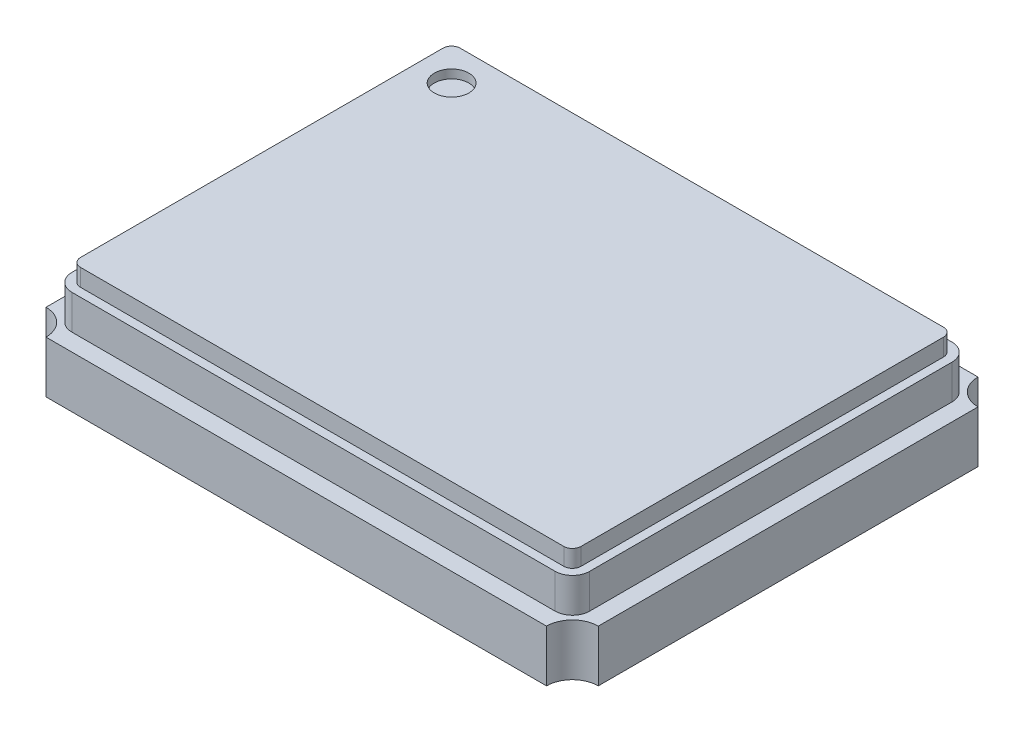
ISO-10303-21;
HEADER;
FILE_DESCRIPTION(('STEP AP214'),'2;1');
FILE_NAME('part.step','',(''),(''),'','','');
FILE_SCHEMA(('AUTOMOTIVE_DESIGN { 1 0 10303 214 1 1 1 1 }'));
ENDSEC;
DATA;
#1=APPLICATION_CONTEXT('core data for automotive mechanical design processes');
#2=APPLICATION_PROTOCOL_DEFINITION('international standard','automotive_design',2000,#1);
#3=PRODUCT_CONTEXT('',#1,'mechanical');
#4=PRODUCT('Part','Part','',(#3));
#5=PRODUCT_RELATED_PRODUCT_CATEGORY('part','',(#4));
#6=PRODUCT_DEFINITION_FORMATION('','',#4);
#7=PRODUCT_DEFINITION_CONTEXT('part definition',#1,'design');
#8=PRODUCT_DEFINITION('design','',#6,#7);
#9=PRODUCT_DEFINITION_SHAPE('','',#8);
#10=(LENGTH_UNIT() NAMED_UNIT(*) SI_UNIT(.MILLI.,.METRE.));
#11=(NAMED_UNIT(*) PLANE_ANGLE_UNIT() SI_UNIT($,.RADIAN.));
#12=(NAMED_UNIT(*) SI_UNIT($,.STERADIAN.) SOLID_ANGLE_UNIT());
#13=UNCERTAINTY_MEASURE_WITH_UNIT(LENGTH_MEASURE(1.E-05),#10,'distance_accuracy_value','');
#14=(GEOMETRIC_REPRESENTATION_CONTEXT(3) GLOBAL_UNCERTAINTY_ASSIGNED_CONTEXT((#13)) GLOBAL_UNIT_ASSIGNED_CONTEXT((#10,
#11,#12)) REPRESENTATION_CONTEXT('',''));
#15=CARTESIAN_POINT('',(0.,0.,0.));
#16=DIRECTION('',(0.,0.,1.));
#17=DIRECTION('',(1.,0.,0.));
#18=AXIS2_PLACEMENT_3D('',#15,#16,#17);
#19=CARTESIAN_POINT('',(-1.4,0.5,1.05));
#20=DIRECTION('',(0.,-1.,0.));
#21=DIRECTION('',(0.,0.,-1.));
#22=AXIS2_PLACEMENT_3D('',#19,#20,#21);
#23=PLANE('',#22);
#24=CARTESIAN_POINT('',(-1.4,0.5,1.05));
#25=DIRECTION('',(0.,1.,0.));
#26=DIRECTION('',(0.,0.,-1.));
#27=AXIS2_PLACEMENT_3D('',#24,#25,#26);
#28=CIRCLE('',#27,0.1);
#29=CARTESIAN_POINT('',(-1.5,0.5,1.05));
#30=VERTEX_POINT('',#29);
#31=CARTESIAN_POINT('',(-1.4,0.5,1.15));
#32=VERTEX_POINT('',#31);
#33=EDGE_CURVE('E257',#30,#32,#28,.T.);
#34=ORIENTED_EDGE('',*,*,#33,.T.);
#35=DIRECTION('',(1.,0.,0.));
#36=VECTOR('',#35,1.);
#37=CARTESIAN_POINT('',(-1.4,0.5,1.15));
#38=LINE('',#37,#36);
#39=CARTESIAN_POINT('',(1.4,0.5,1.15));
#40=VERTEX_POINT('',#39);
#41=EDGE_CURVE('E291',#32,#40,#38,.T.);
#42=ORIENTED_EDGE('',*,*,#41,.T.);
#43=CARTESIAN_POINT('',(1.4,0.5,1.05));
#44=DIRECTION('',(0.,1.,0.));
#45=DIRECTION('',(0.,0.,1.));
#46=AXIS2_PLACEMENT_3D('',#43,#44,#45);
#47=CIRCLE('',#46,0.1);
#48=CARTESIAN_POINT('',(1.5,0.5,1.05));
#49=VERTEX_POINT('',#48);
#50=EDGE_CURVE('E289',#40,#49,#47,.T.);
#51=ORIENTED_EDGE('',*,*,#50,.T.);
#52=DIRECTION('',(0.,0.,-1.));
#53=VECTOR('',#52,1.);
#54=CARTESIAN_POINT('',(1.5,0.5,1.05));
#55=LINE('',#54,#53);
#56=CARTESIAN_POINT('',(1.5,0.5,-1.05));
#57=VERTEX_POINT('',#56);
#58=EDGE_CURVE('E287',#49,#57,#55,.T.);
#59=ORIENTED_EDGE('',*,*,#58,.T.);
#60=CARTESIAN_POINT('',(1.4,0.5,-1.05));
#61=DIRECTION('',(0.,1.,0.));
#62=DIRECTION('',(0.,0.,-1.));
#63=AXIS2_PLACEMENT_3D('',#60,#61,#62);
#64=CIRCLE('',#63,0.1);
#65=CARTESIAN_POINT('',(1.4,0.5,-1.15));
#66=VERTEX_POINT('',#65);
#67=EDGE_CURVE('E285',#57,#66,#64,.T.);
#68=ORIENTED_EDGE('',*,*,#67,.T.);
#69=DIRECTION('',(-1.,0.,0.));
#70=VECTOR('',#69,1.);
#71=CARTESIAN_POINT('',(-1.4,0.5,-1.15));
#72=LINE('',#71,#70);
#73=CARTESIAN_POINT('',(-1.4,0.5,-1.15));
#74=VERTEX_POINT('',#73);
#75=EDGE_CURVE('E283',#66,#74,#72,.T.);
#76=ORIENTED_EDGE('',*,*,#75,.T.);
#77=CARTESIAN_POINT('',(-1.4,0.5,-1.05));
#78=DIRECTION('',(0.,1.,0.));
#79=DIRECTION('',(0.,0.,-1.));
#80=AXIS2_PLACEMENT_3D('',#77,#78,#79);
#81=CIRCLE('',#80,0.1);
#82=CARTESIAN_POINT('',(-1.5,0.5,-1.05));
#83=VERTEX_POINT('',#82);
#84=EDGE_CURVE('E281',#74,#83,#81,.T.);
#85=ORIENTED_EDGE('',*,*,#84,.T.);
#86=DIRECTION('',(0.,0.,1.));
#87=VECTOR('',#86,1.);
#88=CARTESIAN_POINT('',(-1.5,0.5,1.05));
#89=LINE('',#88,#87);
#90=EDGE_CURVE('E253',#83,#30,#89,.T.);
#91=ORIENTED_EDGE('',*,*,#90,.T.);
#92=EDGE_LOOP('',(#34,#42,#51,#59,#68,#76,#85,#91));
#93=FACE_BOUND('',#92,.T.);
#94=CARTESIAN_POINT('',(1.4,0.5,-1.05));
#95=DIRECTION('',(0.,1.,0.));
#96=DIRECTION('',(0.,0.,-1.));
#97=AXIS2_PLACEMENT_3D('',#94,#95,#96);
#98=CIRCLE('',#97,0.0499999999999999);
#99=CARTESIAN_POINT('',(1.45,0.5,-1.05));
#100=VERTEX_POINT('',#99);
#101=CARTESIAN_POINT('',(1.4,0.5,-1.1));
#102=VERTEX_POINT('',#101);
#103=EDGE_CURVE('E341',#100,#102,#98,.T.);
#104=ORIENTED_EDGE('',*,*,#103,.F.);
#105=DIRECTION('',(0.,0.,-1.));
#106=VECTOR('',#105,1.);
#107=CARTESIAN_POINT('',(1.45,0.5,1.05));
#108=LINE('',#107,#106);
#109=CARTESIAN_POINT('',(1.45,0.5,1.05));
#110=VERTEX_POINT('',#109);
#111=EDGE_CURVE('E319',#110,#100,#108,.T.);
#112=ORIENTED_EDGE('',*,*,#111,.F.);
#113=CARTESIAN_POINT('',(1.4,0.5,1.05));
#114=DIRECTION('',(0.,1.,0.));
#115=DIRECTION('',(0.,0.,1.));
#116=AXIS2_PLACEMENT_3D('',#113,#114,#115);
#117=CIRCLE('',#116,0.0499999999999999);
#118=CARTESIAN_POINT('',(1.4,0.5,1.1));
#119=VERTEX_POINT('',#118);
#120=EDGE_CURVE('E323',#119,#110,#117,.T.);
#121=ORIENTED_EDGE('',*,*,#120,.F.);
#122=DIRECTION('',(1.,0.,0.));
#123=VECTOR('',#122,1.);
#124=CARTESIAN_POINT('',(-1.4,0.5,1.1));
#125=LINE('',#124,#123);
#126=CARTESIAN_POINT('',(-1.4,0.5,1.1));
#127=VERTEX_POINT('',#126);
#128=EDGE_CURVE('E326',#127,#119,#125,.T.);
#129=ORIENTED_EDGE('',*,*,#128,.F.);
#130=CARTESIAN_POINT('',(-1.4,0.5,1.05));
#131=DIRECTION('',(0.,1.,0.));
#132=DIRECTION('',(0.,0.,-1.));
#133=AXIS2_PLACEMENT_3D('',#130,#131,#132);
#134=CIRCLE('',#133,0.0499999999999999);
#135=CARTESIAN_POINT('',(-1.45,0.5,1.05));
#136=VERTEX_POINT('',#135);
#137=EDGE_CURVE('E329',#136,#127,#134,.T.);
#138=ORIENTED_EDGE('',*,*,#137,.F.);
#139=DIRECTION('',(0.,0.,1.));
#140=VECTOR('',#139,1.);
#141=CARTESIAN_POINT('',(-1.45,0.5,1.05));
#142=LINE('',#141,#140);
#143=CARTESIAN_POINT('',(-1.45,0.5,-1.05));
#144=VERTEX_POINT('',#143);
#145=EDGE_CURVE('E332',#144,#136,#142,.T.);
#146=ORIENTED_EDGE('',*,*,#145,.F.);
#147=CARTESIAN_POINT('',(-1.4,0.5,-1.05));
#148=DIRECTION('',(0.,1.,0.));
#149=DIRECTION('',(0.,0.,-1.));
#150=AXIS2_PLACEMENT_3D('',#147,#148,#149);
#151=CIRCLE('',#150,0.0499999999999999);
#152=CARTESIAN_POINT('',(-1.4,0.5,-1.1));
#153=VERTEX_POINT('',#152);
#154=EDGE_CURVE('E335',#153,#144,#151,.T.);
#155=ORIENTED_EDGE('',*,*,#154,.F.);
#156=DIRECTION('',(-1.,0.,0.));
#157=VECTOR('',#156,1.);
#158=CARTESIAN_POINT('',(-1.4,0.5,-1.1));
#159=LINE('',#158,#157);
#160=EDGE_CURVE('E338',#102,#153,#159,.T.);
#161=ORIENTED_EDGE('',*,*,#160,.F.);
#162=EDGE_LOOP('',(#104,#112,#121,#129,#138,#146,#155,#161));
#163=FACE_BOUND('',#162,.T.);
#164=ADVANCED_FACE('F33',(#93,#163),#23,.F.);
#165=CARTESIAN_POINT('',(0.,0.3,0.));
#166=DIRECTION('',(0.,-1.,0.));
#167=DIRECTION('',(0.,0.,-1.));
#168=AXIS2_PLACEMENT_3D('',#165,#166,#167);
#169=PLANE('',#168);
#170=DIRECTION('',(0.,0.,1.));
#171=VECTOR('',#170,1.);
#172=CARTESIAN_POINT('',(-1.6,0.3,1.25));
#173=LINE('',#172,#171);
#174=CARTESIAN_POINT('',(-1.6,0.3,-1.1));
#175=VERTEX_POINT('',#174);
#176=CARTESIAN_POINT('',(-1.6,0.3,1.1));
#177=VERTEX_POINT('',#176);
#178=EDGE_CURVE('E207',#175,#177,#173,.T.);
#179=ORIENTED_EDGE('',*,*,#178,.T.);
#180=CARTESIAN_POINT('',(-1.6,0.3,1.25));
#181=DIRECTION('',(0.,1.,0.));
#182=DIRECTION('',(0.,0.,-1.));
#183=AXIS2_PLACEMENT_3D('',#180,#181,#182);
#184=CIRCLE('',#183,0.15);
#185=CARTESIAN_POINT('',(-1.45,0.3,1.25));
#186=VERTEX_POINT('',#185);
#187=EDGE_CURVE('E378',#186,#177,#184,.T.);
#188=ORIENTED_EDGE('',*,*,#187,.F.);
#189=DIRECTION('',(1.,0.,0.));
#190=VECTOR('',#189,1.);
#191=CARTESIAN_POINT('',(-1.6,0.3,1.25));
#192=LINE('',#191,#190);
#193=CARTESIAN_POINT('',(1.45,0.3,1.25));
#194=VERTEX_POINT('',#193);
#195=EDGE_CURVE('E41',#186,#194,#192,.T.);
#196=ORIENTED_EDGE('',*,*,#195,.T.);
#197=CARTESIAN_POINT('',(1.6,0.3,1.25));
#198=DIRECTION('',(0.,1.,0.));
#199=DIRECTION('',(0.,0.,1.));
#200=AXIS2_PLACEMENT_3D('',#197,#198,#199);
#201=CIRCLE('',#200,0.15);
#202=CARTESIAN_POINT('',(1.6,0.3,1.1));
#203=VERTEX_POINT('',#202);
#204=EDGE_CURVE('E380',#203,#194,#201,.T.);
#205=ORIENTED_EDGE('',*,*,#204,.F.);
#206=DIRECTION('',(0.,0.,-1.));
#207=VECTOR('',#206,1.);
#208=CARTESIAN_POINT('',(1.6,0.3,1.25));
#209=LINE('',#208,#207);
#210=CARTESIAN_POINT('',(1.6,0.3,-1.1));
#211=VERTEX_POINT('',#210);
#212=EDGE_CURVE('E215',#203,#211,#209,.T.);
#213=ORIENTED_EDGE('',*,*,#212,.T.);
#214=CARTESIAN_POINT('',(1.6,0.3,-1.25));
#215=DIRECTION('',(0.,1.,0.));
#216=DIRECTION('',(0.,0.,-1.));
#217=AXIS2_PLACEMENT_3D('',#214,#215,#216);
#218=CIRCLE('',#217,0.15);
#219=CARTESIAN_POINT('',(1.45,0.3,-1.25));
#220=VERTEX_POINT('',#219);
#221=EDGE_CURVE('E386',#220,#211,#218,.T.);
#222=ORIENTED_EDGE('',*,*,#221,.F.);
#223=DIRECTION('',(-1.,0.,0.));
#224=VECTOR('',#223,1.);
#225=CARTESIAN_POINT('',(-1.6,0.3,-1.25));
#226=LINE('',#225,#224);
#227=CARTESIAN_POINT('',(-1.45,0.3,-1.25));
#228=VERTEX_POINT('',#227);
#229=EDGE_CURVE('E225',#220,#228,#226,.T.);
#230=ORIENTED_EDGE('',*,*,#229,.T.);
#231=CARTESIAN_POINT('',(-1.6,0.3,-1.25));
#232=DIRECTION('',(0.,1.,0.));
#233=DIRECTION('',(0.,0.,1.));
#234=AXIS2_PLACEMENT_3D('',#231,#232,#233);
#235=CIRCLE('',#234,0.15);
#236=EDGE_CURVE('E199',#175,#228,#235,.T.);
#237=ORIENTED_EDGE('',*,*,#236,.F.);
#238=EDGE_LOOP('',(#179,#188,#196,#205,#213,#222,#230,#237));
#239=FACE_BOUND('',#238,.T.);
#240=CARTESIAN_POINT('',(-1.4,0.3,1.05));
#241=DIRECTION('',(0.,1.,0.));
#242=DIRECTION('',(0.,0.,-1.));
#243=AXIS2_PLACEMENT_3D('',#240,#241,#242);
#244=CIRCLE('',#243,0.1);
#245=CARTESIAN_POINT('',(-1.5,0.3,1.05));
#246=VERTEX_POINT('',#245);
#247=CARTESIAN_POINT('',(-1.4,0.3,1.15));
#248=VERTEX_POINT('',#247);
#249=EDGE_CURVE('E276',#246,#248,#244,.T.);
#250=ORIENTED_EDGE('',*,*,#249,.F.);
#251=DIRECTION('',(0.,0.,1.));
#252=VECTOR('',#251,1.);
#253=CARTESIAN_POINT('',(-1.5,0.3,1.05));
#254=LINE('',#253,#252);
#255=CARTESIAN_POINT('',(-1.5,0.3,-1.05));
#256=VERTEX_POINT('',#255);
#257=EDGE_CURVE('E254',#256,#246,#254,.T.);
#258=ORIENTED_EDGE('',*,*,#257,.F.);
#259=CARTESIAN_POINT('',(-1.4,0.3,-1.05));
#260=DIRECTION('',(0.,1.,0.));
#261=DIRECTION('',(0.,0.,-1.));
#262=AXIS2_PLACEMENT_3D('',#259,#260,#261);
#263=CIRCLE('',#262,0.1);
#264=CARTESIAN_POINT('',(-1.4,0.3,-1.15));
#265=VERTEX_POINT('',#264);
#266=EDGE_CURVE('E258',#265,#256,#263,.T.);
#267=ORIENTED_EDGE('',*,*,#266,.F.);
#268=DIRECTION('',(-1.,0.,0.));
#269=VECTOR('',#268,1.);
#270=CARTESIAN_POINT('',(-1.4,0.3,-1.15));
#271=LINE('',#270,#269);
#272=CARTESIAN_POINT('',(1.4,0.3,-1.15));
#273=VERTEX_POINT('',#272);
#274=EDGE_CURVE('E261',#273,#265,#271,.T.);
#275=ORIENTED_EDGE('',*,*,#274,.F.);
#276=CARTESIAN_POINT('',(1.4,0.3,-1.05));
#277=DIRECTION('',(0.,1.,0.));
#278=DIRECTION('',(0.,0.,-1.));
#279=AXIS2_PLACEMENT_3D('',#276,#277,#278);
#280=CIRCLE('',#279,0.1);
#281=CARTESIAN_POINT('',(1.5,0.3,-1.05));
#282=VERTEX_POINT('',#281);
#283=EDGE_CURVE('E264',#282,#273,#280,.T.);
#284=ORIENTED_EDGE('',*,*,#283,.F.);
#285=DIRECTION('',(0.,0.,-1.));
#286=VECTOR('',#285,1.);
#287=CARTESIAN_POINT('',(1.5,0.3,1.05));
#288=LINE('',#287,#286);
#289=CARTESIAN_POINT('',(1.5,0.3,1.05));
#290=VERTEX_POINT('',#289);
#291=EDGE_CURVE('E267',#290,#282,#288,.T.);
#292=ORIENTED_EDGE('',*,*,#291,.F.);
#293=CARTESIAN_POINT('',(1.4,0.3,1.05));
#294=DIRECTION('',(0.,1.,0.));
#295=DIRECTION('',(0.,0.,1.));
#296=AXIS2_PLACEMENT_3D('',#293,#294,#295);
#297=CIRCLE('',#296,0.1);
#298=CARTESIAN_POINT('',(1.4,0.3,1.15));
#299=VERTEX_POINT('',#298);
#300=EDGE_CURVE('E270',#299,#290,#297,.T.);
#301=ORIENTED_EDGE('',*,*,#300,.F.);
#302=DIRECTION('',(1.,0.,0.));
#303=VECTOR('',#302,1.);
#304=CARTESIAN_POINT('',(-1.4,0.3,1.15));
#305=LINE('',#304,#303);
#306=EDGE_CURVE('E273',#248,#299,#305,.T.);
#307=ORIENTED_EDGE('',*,*,#306,.F.);
#308=EDGE_LOOP('',(#250,#258,#267,#275,#284,#292,#301,#307));
#309=FACE_BOUND('',#308,.T.);
#310=ADVANCED_FACE('F442',(#239,#309),#169,.F.);
#311=CARTESIAN_POINT('',(1.6,0.3,1.25));
#312=DIRECTION('',(-1.,0.,0.));
#313=DIRECTION('',(0.,0.,1.));
#314=AXIS2_PLACEMENT_3D('',#311,#312,#313);
#315=PLANE('',#314);
#316=ORIENTED_EDGE('',*,*,#212,.F.);
#317=DIRECTION('',(0.,1.,0.));
#318=VECTOR('',#317,1.);
#319=CARTESIAN_POINT('',(1.6,0.,1.1));
#320=LINE('',#319,#318);
#321=CARTESIAN_POINT('',(1.6,0.,1.1));
#322=VERTEX_POINT('',#321);
#323=EDGE_CURVE('E363',#203,#322,#320,.F.);
#324=ORIENTED_EDGE('',*,*,#323,.T.);
#325=DIRECTION('',(0.,0.,-1.));
#326=VECTOR('',#325,1.);
#327=CARTESIAN_POINT('',(1.6,0.,1.25));
#328=LINE('',#327,#326);
#329=CARTESIAN_POINT('',(1.6,0.,-1.1));
#330=VERTEX_POINT('',#329);
#331=EDGE_CURVE('E216',#322,#330,#328,.T.);
#332=ORIENTED_EDGE('',*,*,#331,.T.);
#333=DIRECTION('',(0.,1.,0.));
#334=VECTOR('',#333,1.);
#335=CARTESIAN_POINT('',(1.6,0.,-1.1));
#336=LINE('',#335,#334);
#337=EDGE_CURVE('E369',#330,#211,#336,.T.);
#338=ORIENTED_EDGE('',*,*,#337,.T.);
#339=EDGE_LOOP('',(#316,#324,#332,#338));
#340=FACE_BOUND('',#339,.T.);
#341=ADVANCED_FACE('F35',(#340),#315,.F.);
#342=CARTESIAN_POINT('',(-1.6,0.3,-1.25));
#343=DIRECTION('',(0.,0.,1.));
#344=DIRECTION('',(1.,0.,0.));
#345=AXIS2_PLACEMENT_3D('',#342,#343,#344);
#346=PLANE('',#345);
#347=ORIENTED_EDGE('',*,*,#229,.F.);
#348=DIRECTION('',(0.,1.,0.));
#349=VECTOR('',#348,1.);
#350=CARTESIAN_POINT('',(1.45,0.,-1.25));
#351=LINE('',#350,#349);
#352=CARTESIAN_POINT('',(1.45,0.,-1.25));
#353=VERTEX_POINT('',#352);
#354=EDGE_CURVE('E372',#220,#353,#351,.F.);
#355=ORIENTED_EDGE('',*,*,#354,.T.);
#356=DIRECTION('',(-1.,0.,0.));
#357=VECTOR('',#356,1.);
#358=CARTESIAN_POINT('',(-1.6,0.,-1.25));
#359=LINE('',#358,#357);
#360=CARTESIAN_POINT('',(-1.45,0.,-1.25));
#361=VERTEX_POINT('',#360);
#362=EDGE_CURVE('E212',#353,#361,#359,.T.);
#363=ORIENTED_EDGE('',*,*,#362,.T.);
#364=DIRECTION('',(0.,1.,0.));
#365=VECTOR('',#364,1.);
#366=CARTESIAN_POINT('',(-1.45,0.,-1.25));
#367=LINE('',#366,#365);
#368=EDGE_CURVE('E48',#361,#228,#367,.T.);
#369=ORIENTED_EDGE('',*,*,#368,.T.);
#370=EDGE_LOOP('',(#347,#355,#363,#369));
#371=FACE_BOUND('',#370,.T.);
#372=ADVANCED_FACE('F492',(#371),#346,.F.);
#373=CARTESIAN_POINT('',(-1.6,0.3,1.25));
#374=DIRECTION('',(1.,0.,0.));
#375=DIRECTION('',(0.,0.,-1.));
#376=AXIS2_PLACEMENT_3D('',#373,#374,#375);
#377=PLANE('',#376);
#378=DIRECTION('',(0.,0.,1.));
#379=VECTOR('',#378,1.);
#380=CARTESIAN_POINT('',(-1.6,0.,1.25));
#381=LINE('',#380,#379);
#382=CARTESIAN_POINT('',(-1.6,0.,-1.1));
#383=VERTEX_POINT('',#382);
#384=CARTESIAN_POINT('',(-1.6,0.,1.1));
#385=VERTEX_POINT('',#384);
#386=EDGE_CURVE('E205',#383,#385,#381,.T.);
#387=ORIENTED_EDGE('',*,*,#386,.T.);
#388=DIRECTION('',(0.,1.,0.));
#389=VECTOR('',#388,1.);
#390=CARTESIAN_POINT('',(-1.6,0.,1.1));
#391=LINE('',#390,#389);
#392=EDGE_CURVE('E55',#385,#177,#391,.T.);
#393=ORIENTED_EDGE('',*,*,#392,.T.);
#394=ORIENTED_EDGE('',*,*,#178,.F.);
#395=DIRECTION('',(0.,1.,0.));
#396=VECTOR('',#395,1.);
#397=CARTESIAN_POINT('',(-1.6,0.,-1.1));
#398=LINE('',#397,#396);
#399=EDGE_CURVE('E193',#175,#383,#398,.F.);
#400=ORIENTED_EDGE('',*,*,#399,.T.);
#401=EDGE_LOOP('',(#387,#393,#394,#400));
#402=FACE_BOUND('',#401,.T.);
#403=ADVANCED_FACE('F204',(#402),#377,.F.);
#404=CARTESIAN_POINT('',(-1.6,0.3,1.25));
#405=DIRECTION('',(0.,0.,-1.));
#406=DIRECTION('',(-1.,0.,0.));
#407=AXIS2_PLACEMENT_3D('',#404,#405,#406);
#408=PLANE('',#407);
#409=ORIENTED_EDGE('',*,*,#195,.F.);
#410=DIRECTION('',(0.,1.,0.));
#411=VECTOR('',#410,1.);
#412=CARTESIAN_POINT('',(-1.45,0.,1.25));
#413=LINE('',#412,#411);
#414=CARTESIAN_POINT('',(-1.45,0.,1.25));
#415=VERTEX_POINT('',#414);
#416=EDGE_CURVE('E360',#186,#415,#413,.F.);
#417=ORIENTED_EDGE('',*,*,#416,.T.);
#418=DIRECTION('',(1.,0.,0.));
#419=VECTOR('',#418,1.);
#420=CARTESIAN_POINT('',(-1.6,0.,1.25));
#421=LINE('',#420,#419);
#422=CARTESIAN_POINT('',(1.45,0.,1.25));
#423=VERTEX_POINT('',#422);
#424=EDGE_CURVE('E211',#415,#423,#421,.T.);
#425=ORIENTED_EDGE('',*,*,#424,.T.);
#426=DIRECTION('',(0.,1.,0.));
#427=VECTOR('',#426,1.);
#428=CARTESIAN_POINT('',(1.45,0.,1.25));
#429=LINE('',#428,#427);
#430=EDGE_CURVE('E366',#423,#194,#429,.T.);
#431=ORIENTED_EDGE('',*,*,#430,.T.);
#432=EDGE_LOOP('',(#409,#417,#425,#431));
#433=FACE_BOUND('',#432,.T.);
#434=ADVANCED_FACE('F487',(#433),#408,.F.);
#435=CARTESIAN_POINT('',(0.,0.,0.));
#436=DIRECTION('',(0.,-1.,0.));
#437=DIRECTION('',(0.,0.,-1.));
#438=AXIS2_PLACEMENT_3D('',#435,#436,#437);
#439=PLANE('',#438);
#440=CARTESIAN_POINT('',(-1.6,0.,1.25));
#441=DIRECTION('',(0.,-1.,0.));
#442=DIRECTION('',(0.,0.,-1.));
#443=AXIS2_PLACEMENT_3D('',#440,#441,#442);
#444=CIRCLE('',#443,0.15);
#445=EDGE_CURVE('E11',#385,#415,#444,.T.);
#446=ORIENTED_EDGE('',*,*,#445,.F.);
#447=ORIENTED_EDGE('',*,*,#386,.F.);
#448=CARTESIAN_POINT('',(-1.6,0.,-1.25));
#449=DIRECTION('',(0.,1.,0.));
#450=DIRECTION('',(0.,0.,1.));
#451=AXIS2_PLACEMENT_3D('',#448,#449,#450);
#452=CIRCLE('',#451,0.15);
#453=EDGE_CURVE('E190',#383,#361,#452,.T.);
#454=ORIENTED_EDGE('',*,*,#453,.T.);
#455=ORIENTED_EDGE('',*,*,#362,.F.);
#456=CARTESIAN_POINT('',(1.6,0.,-1.25));
#457=DIRECTION('',(0.,1.,0.));
#458=DIRECTION('',(0.,0.,-1.));
#459=AXIS2_PLACEMENT_3D('',#456,#457,#458);
#460=CIRCLE('',#459,0.15);
#461=EDGE_CURVE('E376',#353,#330,#460,.T.);
#462=ORIENTED_EDGE('',*,*,#461,.T.);
#463=ORIENTED_EDGE('',*,*,#331,.F.);
#464=CARTESIAN_POINT('',(1.6,0.,1.25));
#465=DIRECTION('',(0.,1.,0.));
#466=DIRECTION('',(0.,0.,1.));
#467=AXIS2_PLACEMENT_3D('',#464,#465,#466);
#468=CIRCLE('',#467,0.15);
#469=EDGE_CURVE('E383',#322,#423,#468,.T.);
#470=ORIENTED_EDGE('',*,*,#469,.T.);
#471=ORIENTED_EDGE('',*,*,#424,.F.);
#472=EDGE_LOOP('',(#446,#447,#454,#455,#462,#463,#470,#471));
#473=FACE_BOUND('',#472,.T.);
#474=ADVANCED_FACE('F209',(#473),#439,.T.);
#475=CARTESIAN_POINT('',(-1.4,0.5,1.05));
#476=DIRECTION('',(0.,-1.,0.));
#477=DIRECTION('',(0.,0.,-1.));
#478=AXIS2_PLACEMENT_3D('',#475,#476,#477);
#479=CYLINDRICAL_SURFACE('',#478,0.1);
#480=ORIENTED_EDGE('',*,*,#249,.T.);
#481=DIRECTION('',(0.,-1.,0.));
#482=VECTOR('',#481,1.);
#483=CARTESIAN_POINT('',(-1.4,0.5,1.15));
#484=LINE('',#483,#482);
#485=EDGE_CURVE('E221',#32,#248,#484,.T.);
#486=ORIENTED_EDGE('',*,*,#485,.F.);
#487=ORIENTED_EDGE('',*,*,#33,.F.);
#488=DIRECTION('',(0.,-1.,0.));
#489=VECTOR('',#488,1.);
#490=CARTESIAN_POINT('',(-1.5,0.5,1.05));
#491=LINE('',#490,#489);
#492=EDGE_CURVE('E250',#30,#246,#491,.T.);
#493=ORIENTED_EDGE('',*,*,#492,.T.);
#494=EDGE_LOOP('',(#480,#486,#487,#493));
#495=FACE_BOUND('',#494,.T.);
#496=ADVANCED_FACE('F480',(#495),#479,.T.);
#497=CARTESIAN_POINT('',(-1.4,0.5,1.15));
#498=DIRECTION('',(0.,0.,-1.));
#499=DIRECTION('',(-1.,0.,0.));
#500=AXIS2_PLACEMENT_3D('',#497,#498,#499);
#501=PLANE('',#500);
#502=ORIENTED_EDGE('',*,*,#306,.T.);
#503=DIRECTION('',(0.,-1.,0.));
#504=VECTOR('',#503,1.);
#505=CARTESIAN_POINT('',(1.4,0.5,1.15));
#506=LINE('',#505,#504);
#507=EDGE_CURVE('E232',#40,#299,#506,.T.);
#508=ORIENTED_EDGE('',*,*,#507,.F.);
#509=ORIENTED_EDGE('',*,*,#41,.F.);
#510=ORIENTED_EDGE('',*,*,#485,.T.);
#511=EDGE_LOOP('',(#502,#508,#509,#510));
#512=FACE_BOUND('',#511,.T.);
#513=ADVANCED_FACE('F476',(#512),#501,.F.);
#514=CARTESIAN_POINT('',(1.4,0.5,1.05));
#515=DIRECTION('',(0.,-1.,0.));
#516=DIRECTION('',(0.,0.,-1.));
#517=AXIS2_PLACEMENT_3D('',#514,#515,#516);
#518=CYLINDRICAL_SURFACE('',#517,0.1);
#519=ORIENTED_EDGE('',*,*,#300,.T.);
#520=DIRECTION('',(0.,-1.,0.));
#521=VECTOR('',#520,1.);
#522=CARTESIAN_POINT('',(1.5,0.5,1.05));
#523=LINE('',#522,#521);
#524=EDGE_CURVE('E235',#49,#290,#523,.T.);
#525=ORIENTED_EDGE('',*,*,#524,.F.);
#526=ORIENTED_EDGE('',*,*,#50,.F.);
#527=ORIENTED_EDGE('',*,*,#507,.T.);
#528=EDGE_LOOP('',(#519,#525,#526,#527));
#529=FACE_BOUND('',#528,.T.);
#530=ADVANCED_FACE('F472',(#529),#518,.T.);
#531=CARTESIAN_POINT('',(1.5,0.5,1.05));
#532=DIRECTION('',(-1.,0.,0.));
#533=DIRECTION('',(0.,0.,1.));
#534=AXIS2_PLACEMENT_3D('',#531,#532,#533);
#535=PLANE('',#534);
#536=ORIENTED_EDGE('',*,*,#291,.T.);
#537=DIRECTION('',(0.,-1.,0.));
#538=VECTOR('',#537,1.);
#539=CARTESIAN_POINT('',(1.5,0.5,-1.05));
#540=LINE('',#539,#538);
#541=EDGE_CURVE('E238',#57,#282,#540,.T.);
#542=ORIENTED_EDGE('',*,*,#541,.F.);
#543=ORIENTED_EDGE('',*,*,#58,.F.);
#544=ORIENTED_EDGE('',*,*,#524,.T.);
#545=EDGE_LOOP('',(#536,#542,#543,#544));
#546=FACE_BOUND('',#545,.T.);
#547=ADVANCED_FACE('F468',(#546),#535,.F.);
#548=CARTESIAN_POINT('',(1.4,0.5,-1.05));
#549=DIRECTION('',(0.,-1.,0.));
#550=DIRECTION('',(0.,0.,-1.));
#551=AXIS2_PLACEMENT_3D('',#548,#549,#550);
#552=CYLINDRICAL_SURFACE('',#551,0.1);
#553=ORIENTED_EDGE('',*,*,#283,.T.);
#554=DIRECTION('',(0.,-1.,0.));
#555=VECTOR('',#554,1.);
#556=CARTESIAN_POINT('',(1.4,0.5,-1.15));
#557=LINE('',#556,#555);
#558=EDGE_CURVE('E241',#66,#273,#557,.T.);
#559=ORIENTED_EDGE('',*,*,#558,.F.);
#560=ORIENTED_EDGE('',*,*,#67,.F.);
#561=ORIENTED_EDGE('',*,*,#541,.T.);
#562=EDGE_LOOP('',(#553,#559,#560,#561));
#563=FACE_BOUND('',#562,.T.);
#564=ADVANCED_FACE('F464',(#563),#552,.T.);
#565=CARTESIAN_POINT('',(-1.4,0.5,-1.15));
#566=DIRECTION('',(0.,0.,1.));
#567=DIRECTION('',(1.,0.,0.));
#568=AXIS2_PLACEMENT_3D('',#565,#566,#567);
#569=PLANE('',#568);
#570=ORIENTED_EDGE('',*,*,#274,.T.);
#571=DIRECTION('',(0.,-1.,0.));
#572=VECTOR('',#571,1.);
#573=CARTESIAN_POINT('',(-1.4,0.5,-1.15));
#574=LINE('',#573,#572);
#575=EDGE_CURVE('E244',#74,#265,#574,.T.);
#576=ORIENTED_EDGE('',*,*,#575,.F.);
#577=ORIENTED_EDGE('',*,*,#75,.F.);
#578=ORIENTED_EDGE('',*,*,#558,.T.);
#579=EDGE_LOOP('',(#570,#576,#577,#578));
#580=FACE_BOUND('',#579,.T.);
#581=ADVANCED_FACE('F460',(#580),#569,.F.);
#582=CARTESIAN_POINT('',(-1.4,0.5,-1.05));
#583=DIRECTION('',(0.,-1.,0.));
#584=DIRECTION('',(0.,0.,-1.));
#585=AXIS2_PLACEMENT_3D('',#582,#583,#584);
#586=CYLINDRICAL_SURFACE('',#585,0.1);
#587=ORIENTED_EDGE('',*,*,#266,.T.);
#588=DIRECTION('',(0.,-1.,0.));
#589=VECTOR('',#588,1.);
#590=CARTESIAN_POINT('',(-1.5,0.5,-1.05));
#591=LINE('',#590,#589);
#592=EDGE_CURVE('E247',#83,#256,#591,.T.);
#593=ORIENTED_EDGE('',*,*,#592,.F.);
#594=ORIENTED_EDGE('',*,*,#84,.F.);
#595=ORIENTED_EDGE('',*,*,#575,.T.);
#596=EDGE_LOOP('',(#587,#593,#594,#595));
#597=FACE_BOUND('',#596,.T.);
#598=ADVANCED_FACE('F456',(#597),#586,.T.);
#599=CARTESIAN_POINT('',(-1.5,0.5,1.05));
#600=DIRECTION('',(1.,0.,0.));
#601=DIRECTION('',(0.,0.,-1.));
#602=AXIS2_PLACEMENT_3D('',#599,#600,#601);
#603=PLANE('',#602);
#604=ORIENTED_EDGE('',*,*,#257,.T.);
#605=ORIENTED_EDGE('',*,*,#492,.F.);
#606=ORIENTED_EDGE('',*,*,#90,.F.);
#607=ORIENTED_EDGE('',*,*,#592,.T.);
#608=EDGE_LOOP('',(#604,#605,#606,#607));
#609=FACE_BOUND('',#608,.T.);
#610=ADVANCED_FACE('F453',(#609),#603,.F.);
#611=CARTESIAN_POINT('',(1.4,0.6,-1.05));
#612=DIRECTION('',(0.,-1.,0.));
#613=DIRECTION('',(0.,0.,-1.));
#614=AXIS2_PLACEMENT_3D('',#611,#612,#613);
#615=CYLINDRICAL_SURFACE('',#614,0.0499999999999999);
#616=ORIENTED_EDGE('',*,*,#103,.T.);
#617=DIRECTION('',(0.,-1.,0.));
#618=VECTOR('',#617,1.);
#619=CARTESIAN_POINT('',(1.4,0.6,-1.1));
#620=LINE('',#619,#618);
#621=CARTESIAN_POINT('',(1.4,0.6,-1.1));
#622=VERTEX_POINT('',#621);
#623=EDGE_CURVE('E279',#622,#102,#620,.T.);
#624=ORIENTED_EDGE('',*,*,#623,.F.);
#625=CARTESIAN_POINT('',(1.4,0.6,-1.05));
#626=DIRECTION('',(0.,1.,0.));
#627=DIRECTION('',(0.,0.,-1.));
#628=AXIS2_PLACEMENT_3D('',#625,#626,#627);
#629=CIRCLE('',#628,0.0499999999999999);
#630=CARTESIAN_POINT('',(1.45,0.6,-1.05));
#631=VERTEX_POINT('',#630);
#632=EDGE_CURVE('E322',#631,#622,#629,.T.);
#633=ORIENTED_EDGE('',*,*,#632,.F.);
#634=DIRECTION('',(0.,-1.,0.));
#635=VECTOR('',#634,1.);
#636=CARTESIAN_POINT('',(1.45,0.6,-1.05));
#637=LINE('',#636,#635);
#638=EDGE_CURVE('E315',#631,#100,#637,.T.);
#639=ORIENTED_EDGE('',*,*,#638,.T.);
#640=EDGE_LOOP('',(#616,#624,#633,#639));
#641=FACE_BOUND('',#640,.T.);
#642=ADVANCED_FACE('F416',(#641),#615,.T.);
#643=CARTESIAN_POINT('',(-1.4,0.6,-1.1));
#644=DIRECTION('',(0.,0.,1.));
#645=DIRECTION('',(1.,0.,0.));
#646=AXIS2_PLACEMENT_3D('',#643,#644,#645);
#647=PLANE('',#646);
#648=ORIENTED_EDGE('',*,*,#160,.T.);
#649=DIRECTION('',(0.,-1.,0.));
#650=VECTOR('',#649,1.);
#651=CARTESIAN_POINT('',(-1.4,0.6,-1.1));
#652=LINE('',#651,#650);
#653=CARTESIAN_POINT('',(-1.4,0.6,-1.1));
#654=VERTEX_POINT('',#653);
#655=EDGE_CURVE('E297',#654,#153,#652,.T.);
#656=ORIENTED_EDGE('',*,*,#655,.F.);
#657=DIRECTION('',(-1.,0.,0.));
#658=VECTOR('',#657,1.);
#659=CARTESIAN_POINT('',(-1.4,0.6,-1.1));
#660=LINE('',#659,#658);
#661=EDGE_CURVE('E355',#622,#654,#660,.T.);
#662=ORIENTED_EDGE('',*,*,#661,.F.);
#663=ORIENTED_EDGE('',*,*,#623,.T.);
#664=EDGE_LOOP('',(#648,#656,#662,#663));
#665=FACE_BOUND('',#664,.T.);
#666=ADVANCED_FACE('F418',(#665),#647,.F.);
#667=CARTESIAN_POINT('',(-1.4,0.6,-1.05));
#668=DIRECTION('',(0.,-1.,0.));
#669=DIRECTION('',(0.,0.,-1.));
#670=AXIS2_PLACEMENT_3D('',#667,#668,#669);
#671=CYLINDRICAL_SURFACE('',#670,0.0499999999999999);
#672=ORIENTED_EDGE('',*,*,#154,.T.);
#673=DIRECTION('',(0.,-1.,0.));
#674=VECTOR('',#673,1.);
#675=CARTESIAN_POINT('',(-1.45,0.6,-1.05));
#676=LINE('',#675,#674);
#677=CARTESIAN_POINT('',(-1.45,0.6,-1.05));
#678=VERTEX_POINT('',#677);
#679=EDGE_CURVE('E300',#678,#144,#676,.T.);
#680=ORIENTED_EDGE('',*,*,#679,.F.);
#681=CARTESIAN_POINT('',(-1.4,0.6,-1.05));
#682=DIRECTION('',(0.,1.,0.));
#683=DIRECTION('',(0.,0.,-1.));
#684=AXIS2_PLACEMENT_3D('',#681,#682,#683);
#685=CIRCLE('',#684,0.0499999999999999);
#686=EDGE_CURVE('E353',#654,#678,#685,.T.);
#687=ORIENTED_EDGE('',*,*,#686,.F.);
#688=ORIENTED_EDGE('',*,*,#655,.T.);
#689=EDGE_LOOP('',(#672,#680,#687,#688));
#690=FACE_BOUND('',#689,.T.);
#691=ADVANCED_FACE('F422',(#690),#671,.T.);
#692=CARTESIAN_POINT('',(-1.45,0.6,1.05));
#693=DIRECTION('',(1.,0.,0.));
#694=DIRECTION('',(0.,0.,-1.));
#695=AXIS2_PLACEMENT_3D('',#692,#693,#694);
#696=PLANE('',#695);
#697=ORIENTED_EDGE('',*,*,#145,.T.);
#698=DIRECTION('',(0.,-1.,0.));
#699=VECTOR('',#698,1.);
#700=CARTESIAN_POINT('',(-1.45,0.6,1.05));
#701=LINE('',#700,#699);
#702=CARTESIAN_POINT('',(-1.45,0.6,1.05));
#703=VERTEX_POINT('',#702);
#704=EDGE_CURVE('E303',#703,#136,#701,.T.);
#705=ORIENTED_EDGE('',*,*,#704,.F.);
#706=DIRECTION('',(0.,0.,1.));
#707=VECTOR('',#706,1.);
#708=CARTESIAN_POINT('',(-1.45,0.6,1.05));
#709=LINE('',#708,#707);
#710=EDGE_CURVE('E351',#678,#703,#709,.T.);
#711=ORIENTED_EDGE('',*,*,#710,.F.);
#712=ORIENTED_EDGE('',*,*,#679,.T.);
#713=EDGE_LOOP('',(#697,#705,#711,#712));
#714=FACE_BOUND('',#713,.T.);
#715=ADVANCED_FACE('F428',(#714),#696,.F.);
#716=CARTESIAN_POINT('',(-1.4,0.6,1.05));
#717=DIRECTION('',(0.,-1.,0.));
#718=DIRECTION('',(0.,0.,-1.));
#719=AXIS2_PLACEMENT_3D('',#716,#717,#718);
#720=CYLINDRICAL_SURFACE('',#719,0.0499999999999999);
#721=ORIENTED_EDGE('',*,*,#137,.T.);
#722=DIRECTION('',(0.,-1.,0.));
#723=VECTOR('',#722,1.);
#724=CARTESIAN_POINT('',(-1.4,0.6,1.1));
#725=LINE('',#724,#723);
#726=CARTESIAN_POINT('',(-1.4,0.6,1.1));
#727=VERTEX_POINT('',#726);
#728=EDGE_CURVE('E306',#727,#127,#725,.T.);
#729=ORIENTED_EDGE('',*,*,#728,.F.);
#730=CARTESIAN_POINT('',(-1.4,0.6,1.05));
#731=DIRECTION('',(0.,1.,0.));
#732=DIRECTION('',(0.,0.,-1.));
#733=AXIS2_PLACEMENT_3D('',#730,#731,#732);
#734=CIRCLE('',#733,0.0499999999999999);
#735=EDGE_CURVE('E349',#703,#727,#734,.T.);
#736=ORIENTED_EDGE('',*,*,#735,.F.);
#737=ORIENTED_EDGE('',*,*,#704,.T.);
#738=EDGE_LOOP('',(#721,#729,#736,#737));
#739=FACE_BOUND('',#738,.T.);
#740=ADVANCED_FACE('F430',(#739),#720,.T.);
#741=CARTESIAN_POINT('',(-1.4,0.6,1.1));
#742=DIRECTION('',(0.,0.,-1.));
#743=DIRECTION('',(-1.,0.,0.));
#744=AXIS2_PLACEMENT_3D('',#741,#742,#743);
#745=PLANE('',#744);
#746=ORIENTED_EDGE('',*,*,#128,.T.);
#747=DIRECTION('',(0.,-1.,0.));
#748=VECTOR('',#747,1.);
#749=CARTESIAN_POINT('',(1.4,0.6,1.1));
#750=LINE('',#749,#748);
#751=CARTESIAN_POINT('',(1.4,0.6,1.1));
#752=VERTEX_POINT('',#751);
#753=EDGE_CURVE('E309',#752,#119,#750,.T.);
#754=ORIENTED_EDGE('',*,*,#753,.F.);
#755=DIRECTION('',(1.,0.,0.));
#756=VECTOR('',#755,1.);
#757=CARTESIAN_POINT('',(-1.4,0.6,1.1));
#758=LINE('',#757,#756);
#759=EDGE_CURVE('E347',#727,#752,#758,.T.);
#760=ORIENTED_EDGE('',*,*,#759,.F.);
#761=ORIENTED_EDGE('',*,*,#728,.T.);
#762=EDGE_LOOP('',(#746,#754,#760,#761));
#763=FACE_BOUND('',#762,.T.);
#764=ADVANCED_FACE('F434',(#763),#745,.F.);
#765=CARTESIAN_POINT('',(1.4,0.6,1.05));
#766=DIRECTION('',(0.,-1.,0.));
#767=DIRECTION('',(0.,0.,-1.));
#768=AXIS2_PLACEMENT_3D('',#765,#766,#767);
#769=CYLINDRICAL_SURFACE('',#768,0.0499999999999999);
#770=ORIENTED_EDGE('',*,*,#120,.T.);
#771=DIRECTION('',(0.,-1.,0.));
#772=VECTOR('',#771,1.);
#773=CARTESIAN_POINT('',(1.45,0.6,1.05));
#774=LINE('',#773,#772);
#775=CARTESIAN_POINT('',(1.45,0.6,1.05));
#776=VERTEX_POINT('',#775);
#777=EDGE_CURVE('E312',#776,#110,#774,.T.);
#778=ORIENTED_EDGE('',*,*,#777,.F.);
#779=CARTESIAN_POINT('',(1.4,0.6,1.05));
#780=DIRECTION('',(0.,1.,0.));
#781=DIRECTION('',(0.,0.,1.));
#782=AXIS2_PLACEMENT_3D('',#779,#780,#781);
#783=CIRCLE('',#782,0.0499999999999999);
#784=EDGE_CURVE('E345',#752,#776,#783,.T.);
#785=ORIENTED_EDGE('',*,*,#784,.F.);
#786=ORIENTED_EDGE('',*,*,#753,.T.);
#787=EDGE_LOOP('',(#770,#778,#785,#786));
#788=FACE_BOUND('',#787,.T.);
#789=ADVANCED_FACE('F438',(#788),#769,.T.);
#790=CARTESIAN_POINT('',(1.45,0.6,1.05));
#791=DIRECTION('',(-1.,0.,0.));
#792=DIRECTION('',(0.,0.,1.));
#793=AXIS2_PLACEMENT_3D('',#790,#791,#792);
#794=PLANE('',#793);
#795=ORIENTED_EDGE('',*,*,#111,.T.);
#796=ORIENTED_EDGE('',*,*,#638,.F.);
#797=DIRECTION('',(0.,0.,-1.));
#798=VECTOR('',#797,1.);
#799=CARTESIAN_POINT('',(1.45,0.6,1.05));
#800=LINE('',#799,#798);
#801=EDGE_CURVE('E318',#776,#631,#800,.T.);
#802=ORIENTED_EDGE('',*,*,#801,.F.);
#803=ORIENTED_EDGE('',*,*,#777,.T.);
#804=EDGE_LOOP('',(#795,#796,#802,#803));
#805=FACE_BOUND('',#804,.T.);
#806=ADVANCED_FACE('F408',(#805),#794,.F.);
#807=CARTESIAN_POINT('',(1.4,0.6,-1.05));
#808=DIRECTION('',(0.,-1.,0.));
#809=DIRECTION('',(0.,0.,-1.));
#810=AXIS2_PLACEMENT_3D('',#807,#808,#809);
#811=PLANE('',#810);
#812=CARTESIAN_POINT('',(-1.25,0.6,-0.9));
#813=DIRECTION('',(0.,1.,0.));
#814=DIRECTION('',(0.,0.,1.));
#815=AXIS2_PLACEMENT_3D('',#812,#813,#814);
#816=CIRCLE('',#815,0.1);
#817=CARTESIAN_POINT('',(-1.25,0.6,-0.8));
#818=VERTEX_POINT('',#817);
#819=EDGE_CURVE('E390',#818,#818,#816,.T.);
#820=ORIENTED_EDGE('',*,*,#819,.F.);
#821=EDGE_LOOP('',(#820));
#822=FACE_BOUND('',#821,.T.);
#823=ORIENTED_EDGE('',*,*,#632,.T.);
#824=ORIENTED_EDGE('',*,*,#661,.T.);
#825=ORIENTED_EDGE('',*,*,#686,.T.);
#826=ORIENTED_EDGE('',*,*,#710,.T.);
#827=ORIENTED_EDGE('',*,*,#735,.T.);
#828=ORIENTED_EDGE('',*,*,#759,.T.);
#829=ORIENTED_EDGE('',*,*,#784,.T.);
#830=ORIENTED_EDGE('',*,*,#801,.T.);
#831=EDGE_LOOP('',(#823,#824,#825,#826,#827,#828,#829,#830));
#832=FACE_BOUND('',#831,.T.);
#833=ADVANCED_FACE('F405',(#822,#832),#811,.F.);
#834=CARTESIAN_POINT('',(-1.6,0.,-1.25));
#835=DIRECTION('',(0.,1.,0.));
#836=DIRECTION('',(0.,0.,1.));
#837=AXIS2_PLACEMENT_3D('',#834,#835,#836);
#838=CYLINDRICAL_SURFACE('',#837,0.15);
#839=ORIENTED_EDGE('',*,*,#453,.F.);
#840=ORIENTED_EDGE('',*,*,#399,.F.);
#841=ORIENTED_EDGE('',*,*,#236,.T.);
#842=ORIENTED_EDGE('',*,*,#368,.F.);
#843=EDGE_LOOP('',(#839,#840,#841,#842));
#844=FACE_BOUND('',#843,.T.);
#845=ADVANCED_FACE('F192',(#844),#838,.F.);
#846=CARTESIAN_POINT('',(1.6,0.,-1.25));
#847=DIRECTION('',(0.,1.,0.));
#848=DIRECTION('',(0.,0.,1.));
#849=AXIS2_PLACEMENT_3D('',#846,#847,#848);
#850=CYLINDRICAL_SURFACE('',#849,0.15);
#851=ORIENTED_EDGE('',*,*,#461,.F.);
#852=ORIENTED_EDGE('',*,*,#354,.F.);
#853=ORIENTED_EDGE('',*,*,#221,.T.);
#854=ORIENTED_EDGE('',*,*,#337,.F.);
#855=EDGE_LOOP('',(#851,#852,#853,#854));
#856=FACE_BOUND('',#855,.T.);
#857=ADVANCED_FACE('F505',(#856),#850,.F.);
#858=CARTESIAN_POINT('',(1.6,0.,1.25));
#859=DIRECTION('',(0.,1.,0.));
#860=DIRECTION('',(0.,0.,1.));
#861=AXIS2_PLACEMENT_3D('',#858,#859,#860);
#862=CYLINDRICAL_SURFACE('',#861,0.15);
#863=ORIENTED_EDGE('',*,*,#204,.T.);
#864=ORIENTED_EDGE('',*,*,#430,.F.);
#865=ORIENTED_EDGE('',*,*,#469,.F.);
#866=ORIENTED_EDGE('',*,*,#323,.F.);
#867=EDGE_LOOP('',(#863,#864,#865,#866));
#868=FACE_BOUND('',#867,.T.);
#869=ADVANCED_FACE('F510',(#868),#862,.F.);
#870=CARTESIAN_POINT('',(-1.6,0.,1.25));
#871=DIRECTION('',(0.,1.,0.));
#872=DIRECTION('',(0.,0.,1.));
#873=AXIS2_PLACEMENT_3D('',#870,#871,#872);
#874=CYLINDRICAL_SURFACE('',#873,0.15);
#875=ORIENTED_EDGE('',*,*,#445,.T.);
#876=ORIENTED_EDGE('',*,*,#416,.F.);
#877=ORIENTED_EDGE('',*,*,#187,.T.);
#878=ORIENTED_EDGE('',*,*,#392,.F.);
#879=EDGE_LOOP('',(#875,#876,#877,#878));
#880=FACE_BOUND('',#879,.T.);
#881=ADVANCED_FACE('F401',(#880),#874,.F.);
#882=CARTESIAN_POINT('',(-1.25,0.55,-0.9));
#883=DIRECTION('',(0.,1.,0.));
#884=DIRECTION('',(0.,0.,1.));
#885=AXIS2_PLACEMENT_3D('',#882,#883,#884);
#886=CYLINDRICAL_SURFACE('',#885,0.1);
#887=CARTESIAN_POINT('',(-1.25,0.55,-0.9));
#888=DIRECTION('',(0.,1.,0.));
#889=DIRECTION('',(0.,0.,1.));
#890=AXIS2_PLACEMENT_3D('',#887,#888,#889);
#891=CIRCLE('',#890,0.1);
#892=CARTESIAN_POINT('',(-1.25,0.55,-0.8));
#893=VERTEX_POINT('',#892);
#894=EDGE_CURVE('E381',#893,#893,#891,.T.);
#895=ORIENTED_EDGE('',*,*,#894,.F.);
#896=EDGE_LOOP('',(#895));
#897=FACE_BOUND('',#896,.T.);
#898=ORIENTED_EDGE('',*,*,#819,.T.);
#899=EDGE_LOOP('',(#898));
#900=FACE_BOUND('',#899,.T.);
#901=ADVANCED_FACE('F398',(#897,#900),#886,.F.);
#902=CARTESIAN_POINT('',(-1.25,0.55,-0.9));
#903=DIRECTION('',(0.,1.,0.));
#904=DIRECTION('',(0.,0.,1.));
#905=AXIS2_PLACEMENT_3D('',#902,#903,#904);
#906=PLANE('',#905);
#907=ORIENTED_EDGE('',*,*,#894,.T.);
#908=EDGE_LOOP('',(#907));
#909=FACE_BOUND('',#908,.T.);
#910=ADVANCED_FACE('F396',(#909),#906,.T.);
#911=CLOSED_SHELL('',(#164,#310,#341,#372,#403,#434,#474,#496,#513,#530,#547,#564,#581,#598,
#610,#642,#666,#691,#715,#740,#764,#789,#806,#833,#845,#857,#869,#881,#901,#910));
#912=MANIFOLD_SOLID_BREP('B2',#911);
#913=ADVANCED_BREP_SHAPE_REPRESENTATION('',(#18,#912),#14);
#914=SHAPE_DEFINITION_REPRESENTATION(#9,#913);
ENDSEC;
END-ISO-10303-21;
